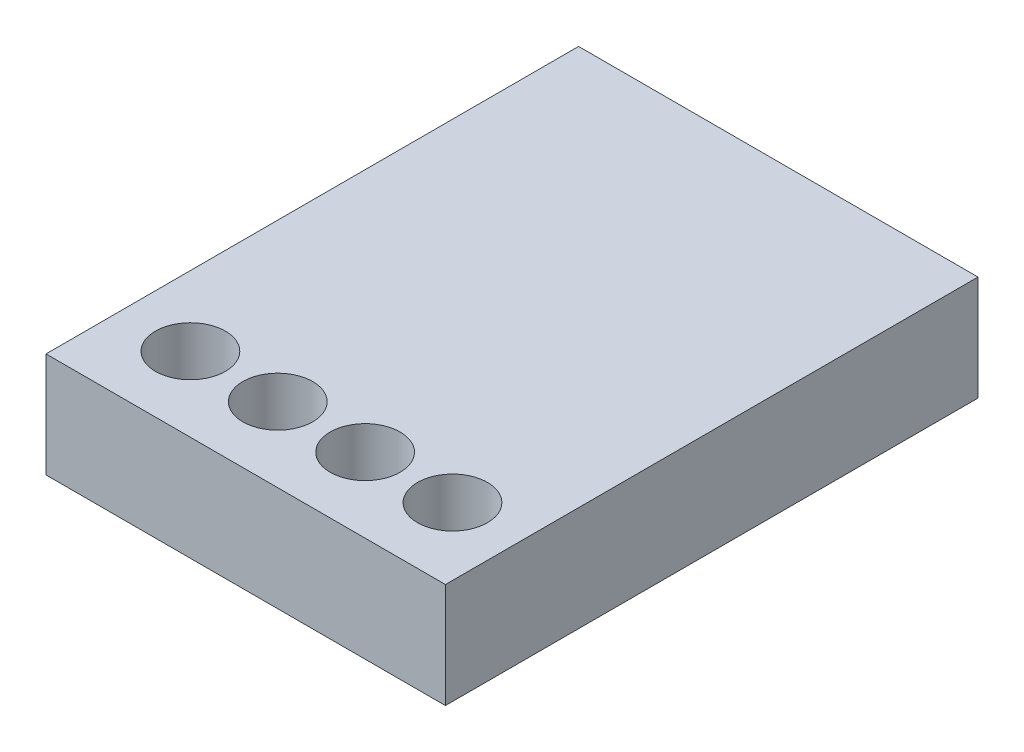
ISO-10303-21;
HEADER;
FILE_DESCRIPTION(('STEP AP214'),'2;1');
FILE_NAME('part.step','',(''),(''),'','','');
FILE_SCHEMA(('AUTOMOTIVE_DESIGN { 1 0 10303 214 1 1 1 1 }'));
ENDSEC;
DATA;
#1=APPLICATION_CONTEXT('core data for automotive mechanical design processes');
#2=APPLICATION_PROTOCOL_DEFINITION('international standard','automotive_design',2000,#1);
#3=PRODUCT_CONTEXT('',#1,'mechanical');
#4=PRODUCT('Part','Part','',(#3));
#5=PRODUCT_RELATED_PRODUCT_CATEGORY('part','',(#4));
#6=PRODUCT_DEFINITION_FORMATION('','',#4);
#7=PRODUCT_DEFINITION_CONTEXT('part definition',#1,'design');
#8=PRODUCT_DEFINITION('design','',#6,#7);
#9=PRODUCT_DEFINITION_SHAPE('','',#8);
#10=(LENGTH_UNIT() NAMED_UNIT(*) SI_UNIT(.MILLI.,.METRE.));
#11=(NAMED_UNIT(*) PLANE_ANGLE_UNIT() SI_UNIT($,.RADIAN.));
#12=(NAMED_UNIT(*) SI_UNIT($,.STERADIAN.) SOLID_ANGLE_UNIT());
#13=UNCERTAINTY_MEASURE_WITH_UNIT(LENGTH_MEASURE(1.E-05),#10,'distance_accuracy_value','');
#14=(GEOMETRIC_REPRESENTATION_CONTEXT(3) GLOBAL_UNCERTAINTY_ASSIGNED_CONTEXT((#13)) GLOBAL_UNIT_ASSIGNED_CONTEXT((#10,
#11,#12)) REPRESENTATION_CONTEXT('',''));
#15=CARTESIAN_POINT('',(0.,0.,0.));
#16=DIRECTION('',(0.,0.,1.));
#17=DIRECTION('',(1.,0.,0.));
#18=AXIS2_PLACEMENT_3D('',#15,#16,#17);
#19=CARTESIAN_POINT('',(-5.89421602787456,3.,-4.36092334494774));
#20=DIRECTION('',(1.,0.,0.));
#21=DIRECTION('',(0.,0.,-1.));
#22=AXIS2_PLACEMENT_3D('',#19,#20,#21);
#23=PLANE('',#22);
#24=DIRECTION('',(0.,0.,1.));
#25=VECTOR('',#24,1.);
#26=CARTESIAN_POINT('',(-5.89421602787456,0.,-4.36092334494774));
#27=LINE('',#26,#25);
#28=CARTESIAN_POINT('',(-5.89421602787456,0.,-4.36092334494774));
#29=VERTEX_POINT('',#28);
#30=CARTESIAN_POINT('',(-5.89421602787456,0.,10.8790766550523));
#31=VERTEX_POINT('',#30);
#32=EDGE_CURVE('E98',#29,#31,#27,.T.);
#33=ORIENTED_EDGE('',*,*,#32,.T.);
#34=DIRECTION('',(0.,-1.,0.));
#35=VECTOR('',#34,1.);
#36=CARTESIAN_POINT('',(-5.89421602787456,3.,10.8790766550523));
#37=LINE('',#36,#35);
#38=CARTESIAN_POINT('',(-5.89421602787456,3.,10.8790766550523));
#39=VERTEX_POINT('',#38);
#40=EDGE_CURVE('E11',#39,#31,#37,.T.);
#41=ORIENTED_EDGE('',*,*,#40,.F.);
#42=DIRECTION('',(0.,0.,1.));
#43=VECTOR('',#42,1.);
#44=CARTESIAN_POINT('',(-5.89421602787456,3.,-4.36092334494774));
#45=LINE('',#44,#43);
#46=CARTESIAN_POINT('',(-5.89421602787456,3.,-4.36092334494774));
#47=VERTEX_POINT('',#46);
#48=EDGE_CURVE('E85',#47,#39,#45,.T.);
#49=ORIENTED_EDGE('',*,*,#48,.F.);
#50=DIRECTION('',(0.,-1.,0.));
#51=VECTOR('',#50,1.);
#52=CARTESIAN_POINT('',(-5.89421602787456,3.,-4.36092334494774));
#53=LINE('',#52,#51);
#54=EDGE_CURVE('E94',#47,#29,#53,.T.);
#55=ORIENTED_EDGE('',*,*,#54,.T.);
#56=EDGE_LOOP('',(#33,#41,#49,#55));
#57=FACE_BOUND('',#56,.T.);
#58=ADVANCED_FACE('F32',(#57),#23,.F.);
#59=CARTESIAN_POINT('',(-5.89421602787456,3.,10.8790766550523));
#60=DIRECTION('',(0.,0.,-1.));
#61=DIRECTION('',(-1.,0.,0.));
#62=AXIS2_PLACEMENT_3D('',#59,#60,#61);
#63=PLANE('',#62);
#64=DIRECTION('',(1.,0.,0.));
#65=VECTOR('',#64,1.);
#66=CARTESIAN_POINT('',(-5.89421602787456,0.,10.8790766550523));
#67=LINE('',#66,#65);
#68=CARTESIAN_POINT('',(5.53578397212544,0.,10.8790766550523));
#69=VERTEX_POINT('',#68);
#70=EDGE_CURVE('E89',#31,#69,#67,.T.);
#71=ORIENTED_EDGE('',*,*,#70,.T.);
#72=DIRECTION('',(0.,-1.,0.));
#73=VECTOR('',#72,1.);
#74=CARTESIAN_POINT('',(5.53578397212544,3.,10.8790766550523));
#75=LINE('',#74,#73);
#76=CARTESIAN_POINT('',(5.53578397212544,3.,10.8790766550523));
#77=VERTEX_POINT('',#76);
#78=EDGE_CURVE('E41',#77,#69,#75,.T.);
#79=ORIENTED_EDGE('',*,*,#78,.F.);
#80=DIRECTION('',(1.,0.,0.));
#81=VECTOR('',#80,1.);
#82=CARTESIAN_POINT('',(-5.89421602787456,3.,10.8790766550523));
#83=LINE('',#82,#81);
#84=EDGE_CURVE('E80',#39,#77,#83,.T.);
#85=ORIENTED_EDGE('',*,*,#84,.F.);
#86=ORIENTED_EDGE('',*,*,#40,.T.);
#87=EDGE_LOOP('',(#71,#79,#85,#86));
#88=FACE_BOUND('',#87,.T.);
#89=ADVANCED_FACE('F88',(#88),#63,.F.);
#90=CARTESIAN_POINT('',(5.53578397212544,3.,-4.36092334494774));
#91=DIRECTION('',(-1.,0.,0.));
#92=DIRECTION('',(0.,0.,1.));
#93=AXIS2_PLACEMENT_3D('',#90,#91,#92);
#94=PLANE('',#93);
#95=DIRECTION('',(0.,0.,-1.));
#96=VECTOR('',#95,1.);
#97=CARTESIAN_POINT('',(5.53578397212544,0.,-4.36092334494774));
#98=LINE('',#97,#96);
#99=CARTESIAN_POINT('',(5.53578397212544,0.,-4.36092334494774));
#100=VERTEX_POINT('',#99);
#101=EDGE_CURVE('E67',#69,#100,#98,.T.);
#102=ORIENTED_EDGE('',*,*,#101,.T.);
#103=DIRECTION('',(0.,-1.,0.));
#104=VECTOR('',#103,1.);
#105=CARTESIAN_POINT('',(5.53578397212544,3.,-4.36092334494774));
#106=LINE('',#105,#104);
#107=CARTESIAN_POINT('',(5.53578397212544,3.,-4.36092334494774));
#108=VERTEX_POINT('',#107);
#109=EDGE_CURVE('E90',#108,#100,#106,.T.);
#110=ORIENTED_EDGE('',*,*,#109,.F.);
#111=DIRECTION('',(0.,0.,-1.));
#112=VECTOR('',#111,1.);
#113=CARTESIAN_POINT('',(5.53578397212544,3.,-4.36092334494774));
#114=LINE('',#113,#112);
#115=EDGE_CURVE('E83',#77,#108,#114,.T.);
#116=ORIENTED_EDGE('',*,*,#115,.F.);
#117=ORIENTED_EDGE('',*,*,#78,.T.);
#118=EDGE_LOOP('',(#102,#110,#116,#117));
#119=FACE_BOUND('',#118,.T.);
#120=ADVANCED_FACE('F92',(#119),#94,.F.);
#121=CARTESIAN_POINT('',(-5.89421602787456,3.,-4.36092334494774));
#122=DIRECTION('',(0.,0.,1.));
#123=DIRECTION('',(1.,0.,0.));
#124=AXIS2_PLACEMENT_3D('',#121,#122,#123);
#125=PLANE('',#124);
#126=DIRECTION('',(-1.,0.,0.));
#127=VECTOR('',#126,1.);
#128=CARTESIAN_POINT('',(-5.89421602787456,0.,-4.36092334494774));
#129=LINE('',#128,#127);
#130=EDGE_CURVE('E73',#100,#29,#129,.T.);
#131=ORIENTED_EDGE('',*,*,#130,.T.);
#132=ORIENTED_EDGE('',*,*,#54,.F.);
#133=DIRECTION('',(-1.,0.,0.));
#134=VECTOR('',#133,1.);
#135=CARTESIAN_POINT('',(-5.89421602787456,3.,-4.36092334494774));
#136=LINE('',#135,#134);
#137=EDGE_CURVE('E50',#108,#47,#136,.T.);
#138=ORIENTED_EDGE('',*,*,#137,.F.);
#139=ORIENTED_EDGE('',*,*,#109,.T.);
#140=EDGE_LOOP('',(#131,#132,#138,#139));
#141=FACE_BOUND('',#140,.T.);
#142=ADVANCED_FACE('F149',(#141),#125,.F.);
#143=CARTESIAN_POINT('',(0.,3.,0.));
#144=DIRECTION('',(0.,1.,0.));
#145=DIRECTION('',(0.,0.,1.));
#146=AXIS2_PLACEMENT_3D('',#143,#144,#145);
#147=PLANE('',#146);
#148=CARTESIAN_POINT('',(-3.89421602787456,3.,8.74706867898567));
#149=DIRECTION('',(0.,1.,0.));
#150=DIRECTION('',(0.,0.,1.));
#151=AXIS2_PLACEMENT_3D('',#148,#149,#150);
#152=CIRCLE('',#151,1.);
#153=CARTESIAN_POINT('',(-3.89421602787456,3.,9.74706867898567));
#154=VERTEX_POINT('',#153);
#155=EDGE_CURVE('E110',#154,#154,#152,.T.);
#156=ORIENTED_EDGE('',*,*,#155,.F.);
#157=EDGE_LOOP('',(#156));
#158=FACE_BOUND('',#157,.T.);
#159=CARTESIAN_POINT('',(-1.39421602787456,3.,8.74706867898567));
#160=DIRECTION('',(0.,1.,0.));
#161=DIRECTION('',(0.,0.,1.));
#162=AXIS2_PLACEMENT_3D('',#159,#160,#161);
#163=CIRCLE('',#162,1.);
#164=CARTESIAN_POINT('',(-1.39421602787456,3.,9.74706867898567));
#165=VERTEX_POINT('',#164);
#166=EDGE_CURVE('E211',#165,#165,#163,.T.);
#167=ORIENTED_EDGE('',*,*,#166,.F.);
#168=EDGE_LOOP('',(#167));
#169=FACE_BOUND('',#168,.T.);
#170=CARTESIAN_POINT('',(1.10578397212544,3.,8.74706867898567));
#171=DIRECTION('',(0.,1.,0.));
#172=DIRECTION('',(0.,0.,1.));
#173=AXIS2_PLACEMENT_3D('',#170,#171,#172);
#174=CIRCLE('',#173,1.);
#175=CARTESIAN_POINT('',(1.10578397212544,3.,9.74706867898567));
#176=VERTEX_POINT('',#175);
#177=EDGE_CURVE('E204',#176,#176,#174,.T.);
#178=ORIENTED_EDGE('',*,*,#177,.F.);
#179=EDGE_LOOP('',(#178));
#180=FACE_BOUND('',#179,.T.);
#181=CARTESIAN_POINT('',(3.60578397212544,3.,8.74706867898567));
#182=DIRECTION('',(0.,1.,0.));
#183=DIRECTION('',(0.,0.,1.));
#184=AXIS2_PLACEMENT_3D('',#181,#182,#183);
#185=CIRCLE('',#184,1.);
#186=CARTESIAN_POINT('',(3.60578397212544,3.,9.74706867898567));
#187=VERTEX_POINT('',#186);
#188=EDGE_CURVE('E212',#187,#187,#185,.T.);
#189=ORIENTED_EDGE('',*,*,#188,.F.);
#190=EDGE_LOOP('',(#189));
#191=FACE_BOUND('',#190,.T.);
#192=ORIENTED_EDGE('',*,*,#48,.T.);
#193=ORIENTED_EDGE('',*,*,#84,.T.);
#194=ORIENTED_EDGE('',*,*,#115,.T.);
#195=ORIENTED_EDGE('',*,*,#137,.T.);
#196=EDGE_LOOP('',(#192,#193,#194,#195));
#197=FACE_BOUND('',#196,.T.);
#198=ADVANCED_FACE('F81',(#158,#169,#180,#191,#197),#147,.T.);
#199=CARTESIAN_POINT('',(0.,0.,0.));
#200=DIRECTION('',(0.,1.,0.));
#201=DIRECTION('',(0.,0.,1.));
#202=AXIS2_PLACEMENT_3D('',#199,#200,#201);
#203=PLANE('',#202);
#204=CARTESIAN_POINT('',(-3.89421602787456,0.,8.74706867898567));
#205=DIRECTION('',(0.,1.,0.));
#206=DIRECTION('',(0.,0.,1.));
#207=AXIS2_PLACEMENT_3D('',#204,#205,#206);
#208=CIRCLE('',#207,1.);
#209=CARTESIAN_POINT('',(-3.89421602787456,0.,9.74706867898567));
#210=VERTEX_POINT('',#209);
#211=EDGE_CURVE('E35',#210,#210,#208,.T.);
#212=ORIENTED_EDGE('',*,*,#211,.T.);
#213=EDGE_LOOP('',(#212));
#214=FACE_BOUND('',#213,.T.);
#215=CARTESIAN_POINT('',(-1.39421602787456,0.,8.74706867898567));
#216=DIRECTION('',(0.,1.,0.));
#217=DIRECTION('',(0.,0.,1.));
#218=AXIS2_PLACEMENT_3D('',#215,#216,#217);
#219=CIRCLE('',#218,1.);
#220=CARTESIAN_POINT('',(-1.39421602787456,0.,9.74706867898567));
#221=VERTEX_POINT('',#220);
#222=EDGE_CURVE('E112',#221,#221,#219,.T.);
#223=ORIENTED_EDGE('',*,*,#222,.T.);
#224=EDGE_LOOP('',(#223));
#225=FACE_BOUND('',#224,.T.);
#226=CARTESIAN_POINT('',(1.10578397212544,0.,8.74706867898567));
#227=DIRECTION('',(0.,1.,0.));
#228=DIRECTION('',(0.,0.,1.));
#229=AXIS2_PLACEMENT_3D('',#226,#227,#228);
#230=CIRCLE('',#229,1.);
#231=CARTESIAN_POINT('',(1.10578397212544,0.,9.74706867898567));
#232=VERTEX_POINT('',#231);
#233=EDGE_CURVE('E109',#232,#232,#230,.T.);
#234=ORIENTED_EDGE('',*,*,#233,.T.);
#235=EDGE_LOOP('',(#234));
#236=FACE_BOUND('',#235,.T.);
#237=CARTESIAN_POINT('',(3.60578397212544,0.,8.74706867898567));
#238=DIRECTION('',(0.,1.,0.));
#239=DIRECTION('',(0.,0.,1.));
#240=AXIS2_PLACEMENT_3D('',#237,#238,#239);
#241=CIRCLE('',#240,1.);
#242=CARTESIAN_POINT('',(3.60578397212544,0.,9.74706867898567));
#243=VERTEX_POINT('',#242);
#244=EDGE_CURVE('E106',#243,#243,#241,.T.);
#245=ORIENTED_EDGE('',*,*,#244,.T.);
#246=EDGE_LOOP('',(#245));
#247=FACE_BOUND('',#246,.T.);
#248=ORIENTED_EDGE('',*,*,#32,.F.);
#249=ORIENTED_EDGE('',*,*,#130,.F.);
#250=ORIENTED_EDGE('',*,*,#101,.F.);
#251=ORIENTED_EDGE('',*,*,#70,.F.);
#252=EDGE_LOOP('',(#248,#249,#250,#251));
#253=FACE_BOUND('',#252,.T.);
#254=ADVANCED_FACE('F119',(#214,#225,#236,#247,#253),#203,.F.);
#255=CARTESIAN_POINT('',(3.60578397212544,-7.,8.74706867898567));
#256=DIRECTION('',(0.,1.,0.));
#257=DIRECTION('',(0.,0.,1.));
#258=AXIS2_PLACEMENT_3D('',#255,#256,#257);
#259=CYLINDRICAL_SURFACE('',#258,1.);
#260=ORIENTED_EDGE('',*,*,#188,.T.);
#261=EDGE_LOOP('',(#260));
#262=FACE_BOUND('',#261,.T.);
#263=ORIENTED_EDGE('',*,*,#244,.F.);
#264=EDGE_LOOP('',(#263));
#265=FACE_BOUND('',#264,.T.);
#266=ADVANCED_FACE('F141',(#262,#265),#259,.F.);
#267=CARTESIAN_POINT('',(1.10578397212544,-7.,8.74706867898567));
#268=DIRECTION('',(0.,1.,0.));
#269=DIRECTION('',(0.,0.,1.));
#270=AXIS2_PLACEMENT_3D('',#267,#268,#269);
#271=CYLINDRICAL_SURFACE('',#270,1.);
#272=ORIENTED_EDGE('',*,*,#177,.T.);
#273=EDGE_LOOP('',(#272));
#274=FACE_BOUND('',#273,.T.);
#275=ORIENTED_EDGE('',*,*,#233,.F.);
#276=EDGE_LOOP('',(#275));
#277=FACE_BOUND('',#276,.T.);
#278=ADVANCED_FACE('F129',(#274,#277),#271,.F.);
#279=CARTESIAN_POINT('',(-1.39421602787456,-7.,8.74706867898567));
#280=DIRECTION('',(0.,1.,0.));
#281=DIRECTION('',(0.,0.,1.));
#282=AXIS2_PLACEMENT_3D('',#279,#280,#281);
#283=CYLINDRICAL_SURFACE('',#282,1.);
#284=ORIENTED_EDGE('',*,*,#166,.T.);
#285=EDGE_LOOP('',(#284));
#286=FACE_BOUND('',#285,.T.);
#287=ORIENTED_EDGE('',*,*,#222,.F.);
#288=EDGE_LOOP('',(#287));
#289=FACE_BOUND('',#288,.T.);
#290=ADVANCED_FACE('F123',(#286,#289),#283,.F.);
#291=CARTESIAN_POINT('',(-3.89421602787456,-7.,8.74706867898567));
#292=DIRECTION('',(0.,1.,0.));
#293=DIRECTION('',(0.,0.,1.));
#294=AXIS2_PLACEMENT_3D('',#291,#292,#293);
#295=CYLINDRICAL_SURFACE('',#294,1.);
#296=ORIENTED_EDGE('',*,*,#155,.T.);
#297=EDGE_LOOP('',(#296));
#298=FACE_BOUND('',#297,.T.);
#299=ORIENTED_EDGE('',*,*,#211,.F.);
#300=EDGE_LOOP('',(#299));
#301=FACE_BOUND('',#300,.T.);
#302=ADVANCED_FACE('F121',(#298,#301),#295,.F.);
#303=CLOSED_SHELL('',(#58,#89,#120,#142,#198,#254,#266,#278,#290,#302));
#304=MANIFOLD_SOLID_BREP('B2',#303);
#305=ADVANCED_BREP_SHAPE_REPRESENTATION('',(#18,#304),#14);
#306=SHAPE_DEFINITION_REPRESENTATION(#9,#305);
ENDSEC;
END-ISO-10303-21;
